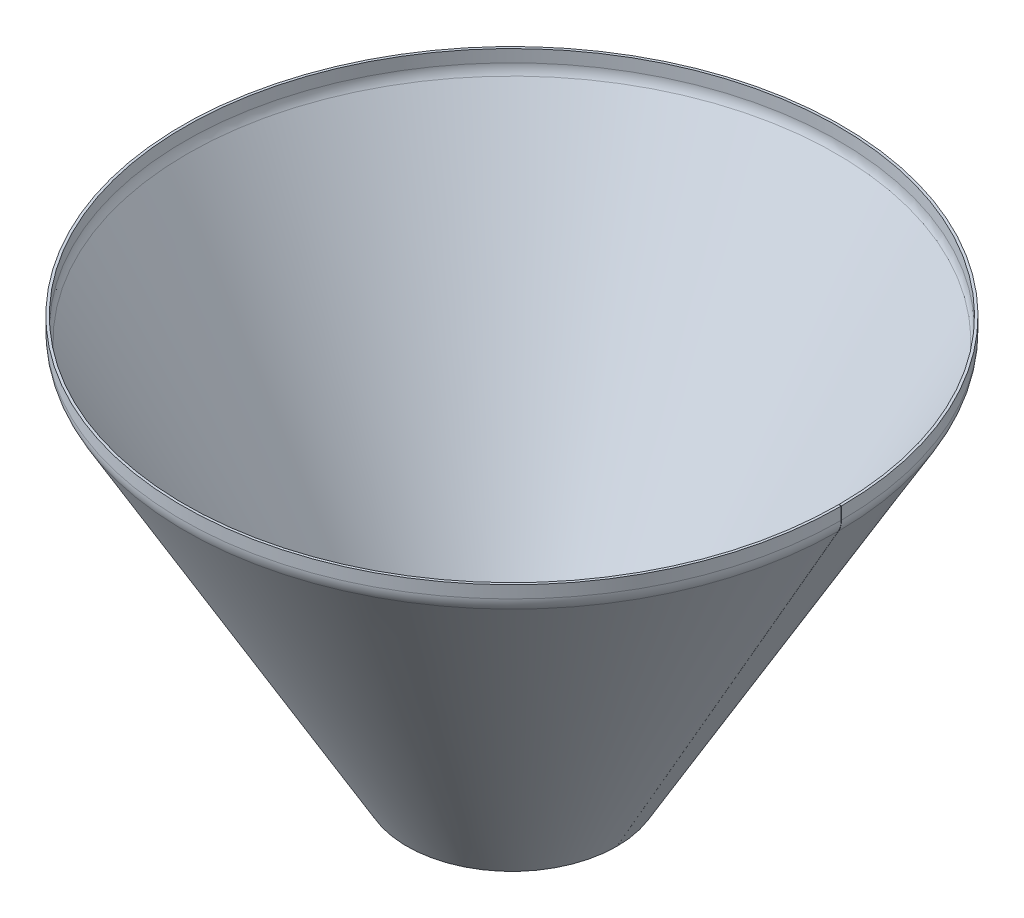
ISO-10303-21;
HEADER;
FILE_DESCRIPTION(('STEP AP214'),'2;1');
FILE_NAME('part.step','',(''),(''),'','','');
FILE_SCHEMA(('AUTOMOTIVE_DESIGN { 1 0 10303 214 1 1 1 1 }'));
ENDSEC;
DATA;
#1=APPLICATION_CONTEXT('core data for automotive mechanical design processes');
#2=APPLICATION_PROTOCOL_DEFINITION('international standard','automotive_design',2000,#1);
#3=PRODUCT_CONTEXT('',#1,'mechanical');
#4=PRODUCT('Part','Part','',(#3));
#5=PRODUCT_RELATED_PRODUCT_CATEGORY('part','',(#4));
#6=PRODUCT_DEFINITION_FORMATION('','',#4);
#7=PRODUCT_DEFINITION_CONTEXT('part definition',#1,'design');
#8=PRODUCT_DEFINITION('design','',#6,#7);
#9=PRODUCT_DEFINITION_SHAPE('','',#8);
#10=(LENGTH_UNIT() NAMED_UNIT(*) SI_UNIT(.MILLI.,.METRE.));
#11=(NAMED_UNIT(*) PLANE_ANGLE_UNIT() SI_UNIT($,.RADIAN.));
#12=(NAMED_UNIT(*) SI_UNIT($,.STERADIAN.) SOLID_ANGLE_UNIT());
#13=UNCERTAINTY_MEASURE_WITH_UNIT(LENGTH_MEASURE(1.E-05),#10,'distance_accuracy_value','');
#14=(GEOMETRIC_REPRESENTATION_CONTEXT(3) GLOBAL_UNCERTAINTY_ASSIGNED_CONTEXT((#13)) GLOBAL_UNIT_ASSIGNED_CONTEXT((#10,
#11,#12)) REPRESENTATION_CONTEXT('',''));
#15=CARTESIAN_POINT('',(0.,0.,0.));
#16=DIRECTION('',(0.,0.,1.));
#17=DIRECTION('',(1.,0.,0.));
#18=AXIS2_PLACEMENT_3D('',#15,#16,#17);
#19=CARTESIAN_POINT('',(-26.5001422182488,-15.,0.32594019644064));
#20=DIRECTION('',(0.000872664515235983,0.,-0.999999619228249));
#21=DIRECTION('',(-0.999999619228249,0.,-0.000872664515235983));
#22=AXIS2_PLACEMENT_3D('',#19,#20,#21);
#23=PLANE('',#22);
#24=DIRECTION('',(-0.999999619228249,0.,-0.000872664515236229));
#25=VECTOR('',#24,1.);
#26=CARTESIAN_POINT('',(-0.000152308700207548,-15.,0.349065806094491));
#27=LINE('',#26,#25);
#28=CARTESIAN_POINT('',(-0.000152308700207548,-15.,0.349065806094491));
#29=VERTEX_POINT('',#28);
#30=CARTESIAN_POINT('',(-3.00015116638497,-15.,0.346447812548798));
#31=VERTEX_POINT('',#30);
#32=EDGE_CURVE('E11',#29,#31,#27,.T.);
#33=ORIENTED_EDGE('',*,*,#32,.F.);
#34=CARTESIAN_POINT('',(-26.5001422182488,-15.,0.32594019644064));
#35=DIRECTION('',(-0.000872664515235983,0.,0.999999619228249));
#36=DIRECTION('',(0.999999619228249,0.,0.000872664515235983));
#37=AXIS2_PLACEMENT_3D('',#34,#35,#36);
#38=CIRCLE('',#37,26.5);
#39=CARTESIAN_POINT('',(-3.55047775654849,-28.25,0.34596756187889));
#40=VERTEX_POINT('',#39);
#41=EDGE_CURVE('E138',#40,#29,#38,.T.);
#42=ORIENTED_EDGE('',*,*,#41,.F.);
#43=DIRECTION('',(-0.866025074026429,0.500000000000001,-0.000755749639175805));
#44=VECTOR('',#43,1.);
#45=CARTESIAN_POINT('',(-3.55047775654849,-28.25,0.34596756187889));
#46=LINE('',#45,#44);
#47=CARTESIAN_POINT('',(-6.14855297862771,-26.75,0.343700312961378));
#48=VERTEX_POINT('',#47);
#49=EDGE_CURVE('E51',#40,#48,#46,.T.);
#50=ORIENTED_EDGE('',*,*,#49,.T.);
#51=CARTESIAN_POINT('',(-26.5001422182488,-15.,0.325940196440663));
#52=DIRECTION('',(-0.000872664515236045,0.,0.999999619228249));
#53=DIRECTION('',(0.999999619228249,0.,0.000872664515236045));
#54=AXIS2_PLACEMENT_3D('',#51,#52,#53);
#55=CIRCLE('',#54,23.5);
#56=EDGE_CURVE('E135',#48,#31,#55,.T.);
#57=ORIENTED_EDGE('',*,*,#56,.T.);
#58=EDGE_LOOP('',(#33,#42,#50,#57));
#59=FACE_BOUND('',#58,.T.);
#60=ADVANCED_FACE('F41',(#59),#23,.T.);
#61=CARTESIAN_POINT('',(-3.55047775654843,-28.25,0.345967561878793));
#62=DIRECTION('',(0.000872664515235983,0.,-0.999999619228249));
#63=DIRECTION('',(0.499999809614126,0.866025403784438,0.000436332257617993));
#64=AXIS2_PLACEMENT_3D('',#61,#62,#63);
#65=PLANE('',#64);
#66=ORIENTED_EDGE('',*,*,#49,.F.);
#67=DIRECTION('',(0.499999809614126,0.866025403784438,0.000436332257617993));
#68=VECTOR('',#67,1.);
#69=CARTESIAN_POINT('',(-3.55047775654843,-28.25,0.345967561878793));
#70=LINE('',#69,#68);
#71=CARTESIAN_POINT('',(-272.500048548398,-494.084498661943,0.111264725692619));
#72=VERTEX_POINT('',#71);
#73=EDGE_CURVE('E180',#72,#40,#70,.T.);
#74=ORIENTED_EDGE('',*,*,#73,.F.);
#75=DIRECTION('',(-0.866025074026429,0.500000000000001,-0.000755749639175805));
#76=VECTOR('',#75,1.);
#77=CARTESIAN_POINT('',(-272.500048548398,-494.084498661943,0.111264725692619));
#78=LINE('',#77,#76);
#79=CARTESIAN_POINT('',(-275.098123770478,-492.584498661943,0.108997476775069));
#80=VERTEX_POINT('',#79);
#81=EDGE_CURVE('E127',#72,#80,#78,.T.);
#82=ORIENTED_EDGE('',*,*,#81,.T.);
#83=DIRECTION('',(0.499999809614126,0.866025403784438,0.000436332257618023));
#84=VECTOR('',#83,1.);
#85=CARTESIAN_POINT('',(-275.098123770478,-492.584498661943,0.108997476775069));
#86=LINE('',#85,#84);
#87=EDGE_CURVE('E155',#80,#48,#86,.T.);
#88=ORIENTED_EDGE('',*,*,#87,.T.);
#89=EDGE_LOOP('',(#66,#74,#82,#88));
#90=FACE_BOUND('',#89,.T.);
#91=ADVANCED_FACE('F156',(#90),#65,.T.);
#92=CARTESIAN_POINT('',(-400.,-494.084498661943,0.));
#93=DIRECTION('',(0.,-1.,0.));
#94=DIRECTION('',(0.,0.,-1.));
#95=AXIS2_PLACEMENT_3D('',#92,#93,#94);
#96=CONICAL_SURFACE('',#95,127.5,1.0471975511966);
#97=ORIENTED_EDGE('',*,*,#81,.F.);
#98=CARTESIAN_POINT('',(-400.,-494.084498661943,0.));
#99=DIRECTION('',(0.,1.,0.));
#100=DIRECTION('',(1.,0.,0.));
#101=AXIS2_PLACEMENT_3D('',#98,#99,#100);
#102=CIRCLE('',#101,127.5);
#103=CARTESIAN_POINT('',(-272.5,-494.084498661943,0.));
#104=VERTEX_POINT('',#103);
#105=EDGE_CURVE('E105',#104,#72,#102,.T.);
#106=ORIENTED_EDGE('',*,*,#105,.F.);
#107=DIRECTION('',(-0.866025403784438,0.500000000000001,0.));
#108=VECTOR('',#107,1.);
#109=CARTESIAN_POINT('',(-272.5,-494.084498661943,0.));
#110=LINE('',#109,#108);
#111=CARTESIAN_POINT('',(-275.098076211353,-492.584498661943,0.));
#112=VERTEX_POINT('',#111);
#113=EDGE_CURVE('E124',#104,#112,#110,.T.);
#114=ORIENTED_EDGE('',*,*,#113,.T.);
#115=CARTESIAN_POINT('',(-400.,-492.584498661943,0.));
#116=DIRECTION('',(0.,1.,0.));
#117=DIRECTION('',(0.,0.,1.));
#118=AXIS2_PLACEMENT_3D('',#115,#116,#117);
#119=CIRCLE('',#118,124.901923788647);
#120=EDGE_CURVE('E160',#112,#80,#119,.T.);
#121=ORIENTED_EDGE('',*,*,#120,.T.);
#122=EDGE_LOOP('',(#97,#106,#114,#121));
#123=FACE_BOUND('',#122,.T.);
#124=ADVANCED_FACE('F219',(#123),#96,.F.);
#125=CARTESIAN_POINT('',(-3.55032679971237,-28.25,0.));
#126=DIRECTION('',(0.,0.,-1.));
#127=DIRECTION('',(0.500000000000001,0.866025403784438,0.));
#128=AXIS2_PLACEMENT_3D('',#125,#126,#127);
#129=PLANE('',#128);
#130=ORIENTED_EDGE('',*,*,#113,.F.);
#131=DIRECTION('',(0.500000000000001,0.866025403784438,0.));
#132=VECTOR('',#131,1.);
#133=CARTESIAN_POINT('',(-3.55032679971237,-28.25,0.));
#134=LINE('',#133,#132);
#135=CARTESIAN_POINT('',(-3.5503267997124,-28.25,0.));
#136=VERTEX_POINT('',#135);
#137=EDGE_CURVE('E177',#104,#136,#134,.T.);
#138=ORIENTED_EDGE('',*,*,#137,.T.);
#139=DIRECTION('',(-0.866025403784438,0.500000000000001,0.));
#140=VECTOR('',#139,1.);
#141=CARTESIAN_POINT('',(-3.5503267997124,-28.25,0.));
#142=LINE('',#141,#140);
#143=CARTESIAN_POINT('',(-6.14840301106567,-26.75,0.));
#144=VERTEX_POINT('',#143);
#145=EDGE_CURVE('E121',#136,#144,#142,.T.);
#146=ORIENTED_EDGE('',*,*,#145,.T.);
#147=DIRECTION('',(0.500000000000001,0.866025403784438,0.));
#148=VECTOR('',#147,1.);
#149=CARTESIAN_POINT('',(-275.098076211353,-492.584498661943,0.));
#150=LINE('',#149,#148);
#151=EDGE_CURVE('E112',#112,#144,#150,.T.);
#152=ORIENTED_EDGE('',*,*,#151,.F.);
#153=EDGE_LOOP('',(#130,#138,#146,#152));
#154=FACE_BOUND('',#153,.T.);
#155=ADVANCED_FACE('F224',(#154),#129,.F.);
#156=CARTESIAN_POINT('',(-26.5,-15.,0.));
#157=DIRECTION('',(0.,0.,-1.));
#158=DIRECTION('',(-1.,0.,0.));
#159=AXIS2_PLACEMENT_3D('',#156,#157,#158);
#160=PLANE('',#159);
#161=ORIENTED_EDGE('',*,*,#145,.F.);
#162=CARTESIAN_POINT('',(-26.5,-15.,0.));
#163=DIRECTION('',(0.,0.,1.));
#164=DIRECTION('',(1.,0.,0.));
#165=AXIS2_PLACEMENT_3D('',#162,#163,#164);
#166=CIRCLE('',#165,26.5);
#167=CARTESIAN_POINT('',(0.,-15.,0.));
#168=VERTEX_POINT('',#167);
#169=EDGE_CURVE('E106',#136,#168,#166,.T.);
#170=ORIENTED_EDGE('',*,*,#169,.T.);
#171=DIRECTION('',(-1.,0.,0.));
#172=VECTOR('',#171,1.);
#173=CARTESIAN_POINT('',(0.,-15.,0.));
#174=LINE('',#173,#172);
#175=CARTESIAN_POINT('',(-2.99999999999995,-15.,0.));
#176=VERTEX_POINT('',#175);
#177=EDGE_CURVE('E95',#168,#176,#174,.T.);
#178=ORIENTED_EDGE('',*,*,#177,.T.);
#179=CARTESIAN_POINT('',(-26.5,-15.,0.));
#180=DIRECTION('',(0.,0.,1.));
#181=DIRECTION('',(1.,0.,0.));
#182=AXIS2_PLACEMENT_3D('',#179,#180,#181);
#183=CIRCLE('',#182,23.5);
#184=EDGE_CURVE('E115',#144,#176,#183,.T.);
#185=ORIENTED_EDGE('',*,*,#184,.F.);
#186=EDGE_LOOP('',(#161,#170,#178,#185));
#187=FACE_BOUND('',#186,.T.);
#188=ADVANCED_FACE('F205',(#187),#160,.F.);
#189=CARTESIAN_POINT('',(0.,-7.5,0.));
#190=DIRECTION('',(0.,0.,-1.));
#191=DIRECTION('',(0.,1.,0.));
#192=AXIS2_PLACEMENT_3D('',#189,#190,#191);
#193=PLANE('',#192);
#194=ORIENTED_EDGE('',*,*,#177,.F.);
#195=DIRECTION('',(0.,1.,0.));
#196=VECTOR('',#195,1.);
#197=CARTESIAN_POINT('',(0.,0.,0.));
#198=LINE('',#197,#196);
#199=CARTESIAN_POINT('',(0.,0.,0.));
#200=VERTEX_POINT('',#199);
#201=EDGE_CURVE('E98',#168,#200,#198,.T.);
#202=ORIENTED_EDGE('',*,*,#201,.T.);
#203=DIRECTION('',(-1.,0.,0.));
#204=VECTOR('',#203,1.);
#205=CARTESIAN_POINT('',(0.,0.,0.));
#206=LINE('',#205,#204);
#207=CARTESIAN_POINT('',(-3.,0.,0.));
#208=VERTEX_POINT('',#207);
#209=EDGE_CURVE('E84',#200,#208,#206,.T.);
#210=ORIENTED_EDGE('',*,*,#209,.T.);
#211=DIRECTION('',(0.,1.,0.));
#212=VECTOR('',#211,1.);
#213=CARTESIAN_POINT('',(-3.,-494.084498661943,0.));
#214=LINE('',#213,#212);
#215=EDGE_CURVE('E172',#176,#208,#214,.T.);
#216=ORIENTED_EDGE('',*,*,#215,.F.);
#217=EDGE_LOOP('',(#194,#202,#210,#216));
#218=FACE_BOUND('',#217,.T.);
#219=ADVANCED_FACE('F99',(#218),#193,.F.);
#220=CARTESIAN_POINT('',(-400.,0.,0.));
#221=DIRECTION('',(0.,-1.,0.));
#222=DIRECTION('',(0.,0.,-1.));
#223=AXIS2_PLACEMENT_3D('',#220,#221,#222);
#224=PLANE('',#223);
#225=ORIENTED_EDGE('',*,*,#209,.F.);
#226=CARTESIAN_POINT('',(-400.,0.,0.));
#227=DIRECTION('',(0.,1.,0.));
#228=DIRECTION('',(1.,0.,0.));
#229=AXIS2_PLACEMENT_3D('',#226,#227,#228);
#230=CIRCLE('',#229,400.);
#231=CARTESIAN_POINT('',(-0.000152308700207548,0.,0.349065806094491));
#232=VERTEX_POINT('',#231);
#233=EDGE_CURVE('E88',#200,#232,#230,.T.);
#234=ORIENTED_EDGE('',*,*,#233,.T.);
#235=DIRECTION('',(-0.999999619228249,0.,-0.000872664515236228));
#236=VECTOR('',#235,1.);
#237=CARTESIAN_POINT('',(-0.000152308700207548,0.,0.349065806094491));
#238=LINE('',#237,#236);
#239=CARTESIAN_POINT('',(-3.00015116638497,0.,0.34644781254871));
#240=VERTEX_POINT('',#239);
#241=EDGE_CURVE('E45',#232,#240,#238,.T.);
#242=ORIENTED_EDGE('',*,*,#241,.T.);
#243=CARTESIAN_POINT('',(-400.,0.,0.));
#244=DIRECTION('',(0.,1.,0.));
#245=DIRECTION('',(0.,0.,1.));
#246=AXIS2_PLACEMENT_3D('',#243,#244,#245);
#247=CIRCLE('',#246,397.);
#248=EDGE_CURVE('E91',#208,#240,#247,.T.);
#249=ORIENTED_EDGE('',*,*,#248,.F.);
#250=EDGE_LOOP('',(#225,#234,#242,#249));
#251=FACE_BOUND('',#250,.T.);
#252=ADVANCED_FACE('F86',(#251),#224,.F.);
#253=CARTESIAN_POINT('',(-0.00015230870020663,-7.5,0.349065806094393));
#254=DIRECTION('',(0.000872664515235983,0.,-0.999999619228249));
#255=DIRECTION('',(0.,1.,0.));
#256=AXIS2_PLACEMENT_3D('',#253,#254,#255);
#257=PLANE('',#256);
#258=DIRECTION('',(0.,1.,0.));
#259=VECTOR('',#258,1.);
#260=CARTESIAN_POINT('',(-0.000152308700207548,0.,0.349065806094393));
#261=LINE('',#260,#259);
#262=EDGE_CURVE('E111',#29,#232,#261,.T.);
#263=ORIENTED_EDGE('',*,*,#262,.F.);
#264=ORIENTED_EDGE('',*,*,#32,.T.);
#265=DIRECTION('',(0.,1.,0.));
#266=VECTOR('',#265,1.);
#267=CARTESIAN_POINT('',(-3.00015116638497,-494.084498661943,0.34644781254871));
#268=LINE('',#267,#266);
#269=EDGE_CURVE('E171',#31,#240,#268,.T.);
#270=ORIENTED_EDGE('',*,*,#269,.T.);
#271=ORIENTED_EDGE('',*,*,#241,.F.);
#272=EDGE_LOOP('',(#263,#264,#270,#271));
#273=FACE_BOUND('',#272,.T.);
#274=ADVANCED_FACE('F43',(#273),#257,.T.);
#275=CARTESIAN_POINT('',(-400.,-494.084498661943,0.));
#276=DIRECTION('',(0.,1.,0.));
#277=DIRECTION('',(0.,0.,1.));
#278=AXIS2_PLACEMENT_3D('',#275,#276,#277);
#279=CYLINDRICAL_SURFACE('',#278,397.);
#280=ORIENTED_EDGE('',*,*,#248,.T.);
#281=ORIENTED_EDGE('',*,*,#269,.F.);
#282=CARTESIAN_POINT('',(-400.,-15.,0.));
#283=DIRECTION('',(0.,1.,0.));
#284=DIRECTION('',(0.,0.,1.));
#285=AXIS2_PLACEMENT_3D('',#282,#283,#284);
#286=CIRCLE('',#285,397.);
#287=EDGE_CURVE('E152',#176,#31,#286,.T.);
#288=ORIENTED_EDGE('',*,*,#287,.F.);
#289=ORIENTED_EDGE('',*,*,#215,.T.);
#290=EDGE_LOOP('',(#280,#281,#288,#289));
#291=FACE_BOUND('',#290,.T.);
#292=ADVANCED_FACE('F207',(#291),#279,.F.);
#293=CARTESIAN_POINT('',(-400.,-15.,0.));
#294=DIRECTION('',(0.,1.,0.));
#295=DIRECTION('',(0.,0.,1.));
#296=AXIS2_PLACEMENT_3D('',#293,#294,#295);
#297=TOROIDAL_SURFACE('',#296,373.5,23.5);
#298=ORIENTED_EDGE('',*,*,#287,.T.);
#299=ORIENTED_EDGE('',*,*,#56,.F.);
#300=CARTESIAN_POINT('',(-400.,-26.75,0.));
#301=DIRECTION('',(0.,1.,0.));
#302=DIRECTION('',(0.,0.,1.));
#303=AXIS2_PLACEMENT_3D('',#300,#301,#302);
#304=CIRCLE('',#303,393.851596988934);
#305=EDGE_CURVE('E150',#144,#48,#304,.T.);
#306=ORIENTED_EDGE('',*,*,#305,.F.);
#307=ORIENTED_EDGE('',*,*,#184,.T.);
#308=EDGE_LOOP('',(#298,#299,#306,#307));
#309=FACE_BOUND('',#308,.T.);
#310=ADVANCED_FACE('F146',(#309),#297,.F.);
#311=CARTESIAN_POINT('',(-400.,-492.584498661943,0.));
#312=DIRECTION('',(0.,1.,0.));
#313=DIRECTION('',(0.,0.,1.));
#314=AXIS2_PLACEMENT_3D('',#311,#312,#313);
#315=CONICAL_SURFACE('',#314,124.901923788647,0.5235987755983);
#316=ORIENTED_EDGE('',*,*,#305,.T.);
#317=ORIENTED_EDGE('',*,*,#87,.F.);
#318=ORIENTED_EDGE('',*,*,#120,.F.);
#319=ORIENTED_EDGE('',*,*,#151,.T.);
#320=EDGE_LOOP('',(#316,#317,#318,#319));
#321=FACE_BOUND('',#320,.T.);
#322=ADVANCED_FACE('F162',(#321),#315,.F.);
#323=CARTESIAN_POINT('',(-400.,-494.084498661943,0.));
#324=DIRECTION('',(0.,1.,0.));
#325=DIRECTION('',(0.,0.,1.));
#326=AXIS2_PLACEMENT_3D('',#323,#324,#325);
#327=CYLINDRICAL_SURFACE('',#326,400.);
#328=ORIENTED_EDGE('',*,*,#233,.F.);
#329=ORIENTED_EDGE('',*,*,#201,.F.);
#330=CARTESIAN_POINT('',(-400.,-15.,0.));
#331=DIRECTION('',(0.,1.,0.));
#332=DIRECTION('',(1.,0.,0.));
#333=AXIS2_PLACEMENT_3D('',#330,#331,#332);
#334=CIRCLE('',#333,400.);
#335=EDGE_CURVE('E117',#168,#29,#334,.T.);
#336=ORIENTED_EDGE('',*,*,#335,.T.);
#337=ORIENTED_EDGE('',*,*,#262,.T.);
#338=EDGE_LOOP('',(#328,#329,#336,#337));
#339=FACE_BOUND('',#338,.T.);
#340=ADVANCED_FACE('F109',(#339),#327,.T.);
#341=CARTESIAN_POINT('',(-400.,-15.,0.));
#342=DIRECTION('',(0.,1.,0.));
#343=DIRECTION('',(0.,0.,1.));
#344=AXIS2_PLACEMENT_3D('',#341,#342,#343);
#345=TOROIDAL_SURFACE('',#344,373.5,26.5);
#346=ORIENTED_EDGE('',*,*,#335,.F.);
#347=ORIENTED_EDGE('',*,*,#169,.F.);
#348=CARTESIAN_POINT('',(-400.,-28.25,0.));
#349=DIRECTION('',(0.,1.,0.));
#350=DIRECTION('',(1.,0.,0.));
#351=AXIS2_PLACEMENT_3D('',#348,#349,#350);
#352=CIRCLE('',#351,396.449673200288);
#353=EDGE_CURVE('E183',#136,#40,#352,.T.);
#354=ORIENTED_EDGE('',*,*,#353,.T.);
#355=ORIENTED_EDGE('',*,*,#41,.T.);
#356=EDGE_LOOP('',(#346,#347,#354,#355));
#357=FACE_BOUND('',#356,.T.);
#358=ADVANCED_FACE('F191',(#357),#345,.T.);
#359=CARTESIAN_POINT('',(-400.,-494.084498661943,0.));
#360=DIRECTION('',(0.,1.,0.));
#361=DIRECTION('',(0.,0.,1.));
#362=AXIS2_PLACEMENT_3D('',#359,#360,#361);
#363=CONICAL_SURFACE('',#362,127.5,0.5235987755983);
#364=ORIENTED_EDGE('',*,*,#353,.F.);
#365=ORIENTED_EDGE('',*,*,#137,.F.);
#366=ORIENTED_EDGE('',*,*,#105,.T.);
#367=ORIENTED_EDGE('',*,*,#73,.T.);
#368=EDGE_LOOP('',(#364,#365,#366,#367));
#369=FACE_BOUND('',#368,.T.);
#370=ADVANCED_FACE('F238',(#369),#363,.T.);
#371=CLOSED_SHELL('',(#60,#91,#124,#155,#188,#219,#252,#274,#292,#310,#322,#340,#358,#370));
#372=MANIFOLD_SOLID_BREP('B2',#371);
#373=ADVANCED_BREP_SHAPE_REPRESENTATION('',(#18,#372),#14);
#374=SHAPE_DEFINITION_REPRESENTATION(#9,#373);
ENDSEC;
END-ISO-10303-21;
